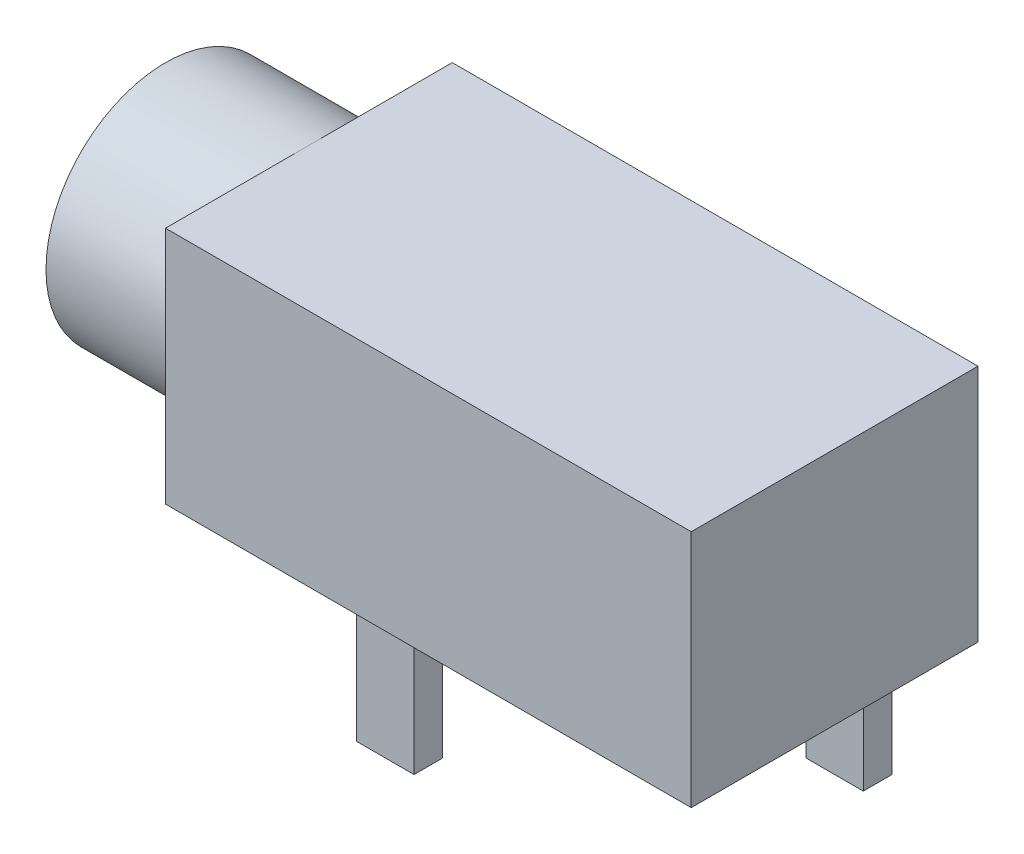
ISO-10303-21;
HEADER;
FILE_DESCRIPTION(('STEP AP214'),'2;1');
FILE_NAME('part.step','',(''),(''),'','','');
FILE_SCHEMA(('AUTOMOTIVE_DESIGN { 1 0 10303 214 1 1 1 1 }'));
ENDSEC;
DATA;
#1=APPLICATION_CONTEXT('core data for automotive mechanical design processes');
#2=APPLICATION_PROTOCOL_DEFINITION('international standard','automotive_design',2000,#1);
#3=PRODUCT_CONTEXT('',#1,'mechanical');
#4=PRODUCT('Part','Part','',(#3));
#5=PRODUCT_RELATED_PRODUCT_CATEGORY('part','',(#4));
#6=PRODUCT_DEFINITION_FORMATION('','',#4);
#7=PRODUCT_DEFINITION_CONTEXT('part definition',#1,'design');
#8=PRODUCT_DEFINITION('design','',#6,#7);
#9=PRODUCT_DEFINITION_SHAPE('','',#8);
#10=(LENGTH_UNIT() NAMED_UNIT(*) SI_UNIT(.MILLI.,.METRE.));
#11=(NAMED_UNIT(*) PLANE_ANGLE_UNIT() SI_UNIT($,.RADIAN.));
#12=(NAMED_UNIT(*) SI_UNIT($,.STERADIAN.) SOLID_ANGLE_UNIT());
#13=UNCERTAINTY_MEASURE_WITH_UNIT(LENGTH_MEASURE(1.E-05),#10,'distance_accuracy_value','');
#14=(GEOMETRIC_REPRESENTATION_CONTEXT(3) GLOBAL_UNCERTAINTY_ASSIGNED_CONTEXT((#13)) GLOBAL_UNIT_ASSIGNED_CONTEXT((#10,
#11,#12)) REPRESENTATION_CONTEXT('',''));
#15=CARTESIAN_POINT('',(0.,0.,0.));
#16=DIRECTION('',(0.,0.,1.));
#17=DIRECTION('',(1.,0.,0.));
#18=AXIS2_PLACEMENT_3D('',#15,#16,#17);
#19=CARTESIAN_POINT('',(0.,0.,0.));
#20=DIRECTION('',(0.,1.,0.));
#21=DIRECTION('',(0.,0.,1.));
#22=AXIS2_PLACEMENT_3D('',#19,#20,#21);
#23=PLANE('',#22);
#24=DIRECTION('',(0.,0.,-1.));
#25=VECTOR('',#24,1.);
#26=CARTESIAN_POINT('',(8.5,0.,1.1));
#27=LINE('',#26,#25);
#28=CARTESIAN_POINT('',(8.5,0.,1.1));
#29=VERTEX_POINT('',#28);
#30=CARTESIAN_POINT('',(8.5,0.,0.5));
#31=VERTEX_POINT('',#30);
#32=EDGE_CURVE('E175',#29,#31,#27,.T.);
#33=ORIENTED_EDGE('',*,*,#32,.F.);
#34=DIRECTION('',(-1.,0.,0.));
#35=VECTOR('',#34,1.);
#36=CARTESIAN_POINT('',(8.5,0.,1.1));
#37=LINE('',#36,#35);
#38=CARTESIAN_POINT('',(9.7,0.,1.1));
#39=VERTEX_POINT('',#38);
#40=EDGE_CURVE('E188',#39,#29,#37,.T.);
#41=ORIENTED_EDGE('',*,*,#40,.F.);
#42=DIRECTION('',(0.,0.,1.));
#43=VECTOR('',#42,1.);
#44=CARTESIAN_POINT('',(9.7,0.,1.1));
#45=LINE('',#44,#43);
#46=CARTESIAN_POINT('',(9.7,0.,0.5));
#47=VERTEX_POINT('',#46);
#48=EDGE_CURVE('E197',#47,#39,#45,.T.);
#49=ORIENTED_EDGE('',*,*,#48,.F.);
#50=DIRECTION('',(1.,0.,0.));
#51=VECTOR('',#50,1.);
#52=CARTESIAN_POINT('',(8.5,0.,0.5));
#53=LINE('',#52,#51);
#54=EDGE_CURVE('E178',#31,#47,#53,.T.);
#55=ORIENTED_EDGE('',*,*,#54,.F.);
#56=EDGE_LOOP('',(#33,#41,#49,#55));
#57=FACE_BOUND('',#56,.T.);
#58=DIRECTION('',(0.,0.,1.));
#59=VECTOR('',#58,1.);
#60=CARTESIAN_POINT('',(0.,0.,0.));
#61=LINE('',#60,#59);
#62=CARTESIAN_POINT('',(0.,0.,0.));
#63=VERTEX_POINT('',#62);
#64=CARTESIAN_POINT('',(0.,0.,3.));
#65=VERTEX_POINT('',#64);
#66=EDGE_CURVE('E261',#63,#65,#61,.T.);
#67=ORIENTED_EDGE('',*,*,#66,.F.);
#68=DIRECTION('',(-1.,0.,0.));
#69=VECTOR('',#68,1.);
#70=CARTESIAN_POINT('',(0.,0.,0.));
#71=LINE('',#70,#69);
#72=CARTESIAN_POINT('',(11.,0.,0.));
#73=VERTEX_POINT('',#72);
#74=EDGE_CURVE('E268',#73,#63,#71,.T.);
#75=ORIENTED_EDGE('',*,*,#74,.F.);
#76=DIRECTION('',(0.,0.,-1.));
#77=VECTOR('',#76,1.);
#78=CARTESIAN_POINT('',(11.,0.,0.));
#79=LINE('',#78,#77);
#80=CARTESIAN_POINT('',(11.,0.,6.));
#81=VERTEX_POINT('',#80);
#82=EDGE_CURVE('E266',#81,#73,#79,.T.);
#83=ORIENTED_EDGE('',*,*,#82,.F.);
#84=DIRECTION('',(1.,0.,0.));
#85=VECTOR('',#84,1.);
#86=CARTESIAN_POINT('',(0.,0.,6.));
#87=LINE('',#86,#85);
#88=CARTESIAN_POINT('',(0.,0.,6.));
#89=VERTEX_POINT('',#88);
#90=EDGE_CURVE('E264',#89,#81,#87,.T.);
#91=ORIENTED_EDGE('',*,*,#90,.F.);
#92=EDGE_CURVE('E248',#65,#89,#61,.T.);
#93=ORIENTED_EDGE('',*,*,#92,.F.);
#94=EDGE_LOOP('',(#67,#75,#83,#91,#93));
#95=FACE_BOUND('',#94,.T.);
#96=DIRECTION('',(0.,0.,-1.));
#97=VECTOR('',#96,1.);
#98=CARTESIAN_POINT('',(1.5,0.,1.1));
#99=LINE('',#98,#97);
#100=CARTESIAN_POINT('',(1.5,0.,1.1));
#101=VERTEX_POINT('',#100);
#102=CARTESIAN_POINT('',(1.5,0.,0.5));
#103=VERTEX_POINT('',#102);
#104=EDGE_CURVE('E213',#101,#103,#99,.T.);
#105=ORIENTED_EDGE('',*,*,#104,.F.);
#106=DIRECTION('',(-1.,0.,0.));
#107=VECTOR('',#106,1.);
#108=CARTESIAN_POINT('',(1.5,0.,1.1));
#109=LINE('',#108,#107);
#110=CARTESIAN_POINT('',(2.7,0.,1.1));
#111=VERTEX_POINT('',#110);
#112=EDGE_CURVE('E218',#111,#101,#109,.T.);
#113=ORIENTED_EDGE('',*,*,#112,.F.);
#114=DIRECTION('',(0.,0.,1.));
#115=VECTOR('',#114,1.);
#116=CARTESIAN_POINT('',(2.7,0.,1.1));
#117=LINE('',#116,#115);
#118=CARTESIAN_POINT('',(2.7,0.,0.5));
#119=VERTEX_POINT('',#118);
#120=EDGE_CURVE('E230',#119,#111,#117,.T.);
#121=ORIENTED_EDGE('',*,*,#120,.F.);
#122=DIRECTION('',(1.,0.,0.));
#123=VECTOR('',#122,1.);
#124=CARTESIAN_POINT('',(1.5,0.,0.5));
#125=LINE('',#124,#123);
#126=EDGE_CURVE('E227',#103,#119,#125,.T.);
#127=ORIENTED_EDGE('',*,*,#126,.F.);
#128=EDGE_LOOP('',(#105,#113,#121,#127));
#129=FACE_BOUND('',#128,.T.);
#130=DIRECTION('',(0.,0.,-1.));
#131=VECTOR('',#130,1.);
#132=CARTESIAN_POINT('',(3.5,0.,5.5));
#133=LINE('',#132,#131);
#134=CARTESIAN_POINT('',(3.5,0.,5.5));
#135=VERTEX_POINT('',#134);
#136=CARTESIAN_POINT('',(3.5,0.,4.9));
#137=VERTEX_POINT('',#136);
#138=EDGE_CURVE('E174',#135,#137,#133,.T.);
#139=ORIENTED_EDGE('',*,*,#138,.F.);
#140=DIRECTION('',(-1.,0.,0.));
#141=VECTOR('',#140,1.);
#142=CARTESIAN_POINT('',(3.5,0.,5.5));
#143=LINE('',#142,#141);
#144=CARTESIAN_POINT('',(4.7,0.,5.5));
#145=VERTEX_POINT('',#144);
#146=EDGE_CURVE('E171',#145,#135,#143,.T.);
#147=ORIENTED_EDGE('',*,*,#146,.F.);
#148=DIRECTION('',(0.,0.,1.));
#149=VECTOR('',#148,1.);
#150=CARTESIAN_POINT('',(4.7,0.,5.5));
#151=LINE('',#150,#149);
#152=CARTESIAN_POINT('',(4.7,0.,4.9));
#153=VERTEX_POINT('',#152);
#154=EDGE_CURVE('E55',#153,#145,#151,.T.);
#155=ORIENTED_EDGE('',*,*,#154,.F.);
#156=DIRECTION('',(1.,0.,0.));
#157=VECTOR('',#156,1.);
#158=CARTESIAN_POINT('',(3.5,0.,4.9));
#159=LINE('',#158,#157);
#160=EDGE_CURVE('E50',#137,#153,#159,.T.);
#161=ORIENTED_EDGE('',*,*,#160,.F.);
#162=EDGE_LOOP('',(#139,#147,#155,#161));
#163=FACE_BOUND('',#162,.T.);
#164=ADVANCED_FACE('F33',(#57,#95,#129,#163),#23,.F.);
#165=CARTESIAN_POINT('',(0.,5.,0.));
#166=DIRECTION('',(1.,0.,0.));
#167=DIRECTION('',(0.,0.,-1.));
#168=AXIS2_PLACEMENT_3D('',#165,#166,#167);
#169=PLANE('',#168);
#170=CARTESIAN_POINT('',(0.,2.5,3.));
#171=DIRECTION('',(-1.,0.,0.));
#172=DIRECTION('',(0.,0.,1.));
#173=AXIS2_PLACEMENT_3D('',#170,#171,#172);
#174=CIRCLE('',#173,2.5);
#175=CARTESIAN_POINT('',(0.,5.,3.));
#176=VERTEX_POINT('',#175);
#177=EDGE_CURVE('E43',#176,#65,#174,.T.);
#178=ORIENTED_EDGE('',*,*,#177,.F.);
#179=DIRECTION('',(0.,0.,1.));
#180=VECTOR('',#179,1.);
#181=CARTESIAN_POINT('',(0.,5.,0.));
#182=LINE('',#181,#180);
#183=CARTESIAN_POINT('',(0.,5.,0.));
#184=VERTEX_POINT('',#183);
#185=EDGE_CURVE('E251',#184,#176,#182,.T.);
#186=ORIENTED_EDGE('',*,*,#185,.F.);
#187=DIRECTION('',(0.,-1.,0.));
#188=VECTOR('',#187,1.);
#189=CARTESIAN_POINT('',(0.,5.,0.));
#190=LINE('',#189,#188);
#191=EDGE_CURVE('E260',#184,#63,#190,.T.);
#192=ORIENTED_EDGE('',*,*,#191,.T.);
#193=ORIENTED_EDGE('',*,*,#66,.T.);
#194=EDGE_LOOP('',(#178,#186,#192,#193));
#195=FACE_BOUND('',#194,.T.);
#196=ADVANCED_FACE('F304',(#195),#169,.F.);
#197=EDGE_CURVE('E11',#65,#176,#174,.T.);
#198=ORIENTED_EDGE('',*,*,#197,.F.);
#199=ORIENTED_EDGE('',*,*,#92,.T.);
#200=DIRECTION('',(0.,-1.,0.));
#201=VECTOR('',#200,1.);
#202=CARTESIAN_POINT('',(0.,5.,6.));
#203=LINE('',#202,#201);
#204=CARTESIAN_POINT('',(0.,5.,6.));
#205=VERTEX_POINT('',#204);
#206=EDGE_CURVE('E37',#205,#89,#203,.T.);
#207=ORIENTED_EDGE('',*,*,#206,.F.);
#208=EDGE_CURVE('E254',#176,#205,#182,.T.);
#209=ORIENTED_EDGE('',*,*,#208,.F.);
#210=EDGE_LOOP('',(#198,#199,#207,#209));
#211=FACE_BOUND('',#210,.T.);
#212=ADVANCED_FACE('F35',(#211),#169,.F.);
#213=CARTESIAN_POINT('',(0.,5.,6.));
#214=DIRECTION('',(0.,0.,-1.));
#215=DIRECTION('',(-1.,0.,0.));
#216=AXIS2_PLACEMENT_3D('',#213,#214,#215);
#217=PLANE('',#216);
#218=ORIENTED_EDGE('',*,*,#90,.T.);
#219=DIRECTION('',(0.,-1.,0.));
#220=VECTOR('',#219,1.);
#221=CARTESIAN_POINT('',(11.,5.,6.));
#222=LINE('',#221,#220);
#223=CARTESIAN_POINT('',(11.,5.,6.));
#224=VERTEX_POINT('',#223);
#225=EDGE_CURVE('E274',#224,#81,#222,.T.);
#226=ORIENTED_EDGE('',*,*,#225,.F.);
#227=DIRECTION('',(1.,0.,0.));
#228=VECTOR('',#227,1.);
#229=CARTESIAN_POINT('',(0.,5.,6.));
#230=LINE('',#229,#228);
#231=EDGE_CURVE('E253',#205,#224,#230,.T.);
#232=ORIENTED_EDGE('',*,*,#231,.F.);
#233=ORIENTED_EDGE('',*,*,#206,.T.);
#234=EDGE_LOOP('',(#218,#226,#232,#233));
#235=FACE_BOUND('',#234,.T.);
#236=ADVANCED_FACE('F284',(#235),#217,.F.);
#237=CARTESIAN_POINT('',(11.,5.,0.));
#238=DIRECTION('',(-1.,0.,0.));
#239=DIRECTION('',(0.,0.,1.));
#240=AXIS2_PLACEMENT_3D('',#237,#238,#239);
#241=PLANE('',#240);
#242=ORIENTED_EDGE('',*,*,#82,.T.);
#243=DIRECTION('',(0.,-1.,0.));
#244=VECTOR('',#243,1.);
#245=CARTESIAN_POINT('',(11.,5.,0.));
#246=LINE('',#245,#244);
#247=CARTESIAN_POINT('',(11.,5.,0.));
#248=VERTEX_POINT('',#247);
#249=EDGE_CURVE('E272',#248,#73,#246,.T.);
#250=ORIENTED_EDGE('',*,*,#249,.F.);
#251=DIRECTION('',(0.,0.,-1.));
#252=VECTOR('',#251,1.);
#253=CARTESIAN_POINT('',(11.,5.,0.));
#254=LINE('',#253,#252);
#255=EDGE_CURVE('E256',#224,#248,#254,.T.);
#256=ORIENTED_EDGE('',*,*,#255,.F.);
#257=ORIENTED_EDGE('',*,*,#225,.T.);
#258=EDGE_LOOP('',(#242,#250,#256,#257));
#259=FACE_BOUND('',#258,.T.);
#260=ADVANCED_FACE('F295',(#259),#241,.F.);
#261=CARTESIAN_POINT('',(0.,5.,0.));
#262=DIRECTION('',(0.,0.,1.));
#263=DIRECTION('',(1.,0.,0.));
#264=AXIS2_PLACEMENT_3D('',#261,#262,#263);
#265=PLANE('',#264);
#266=ORIENTED_EDGE('',*,*,#74,.T.);
#267=ORIENTED_EDGE('',*,*,#191,.F.);
#268=DIRECTION('',(-1.,0.,0.));
#269=VECTOR('',#268,1.);
#270=CARTESIAN_POINT('',(0.,5.,0.));
#271=LINE('',#270,#269);
#272=EDGE_CURVE('E258',#248,#184,#271,.T.);
#273=ORIENTED_EDGE('',*,*,#272,.F.);
#274=ORIENTED_EDGE('',*,*,#249,.T.);
#275=EDGE_LOOP('',(#266,#267,#273,#274));
#276=FACE_BOUND('',#275,.T.);
#277=ADVANCED_FACE('F298',(#276),#265,.F.);
#278=CARTESIAN_POINT('',(0.,5.,0.));
#279=DIRECTION('',(0.,1.,0.));
#280=DIRECTION('',(0.,0.,1.));
#281=AXIS2_PLACEMENT_3D('',#278,#279,#280);
#282=PLANE('',#281);
#283=ORIENTED_EDGE('',*,*,#185,.T.);
#284=ORIENTED_EDGE('',*,*,#208,.T.);
#285=ORIENTED_EDGE('',*,*,#231,.T.);
#286=ORIENTED_EDGE('',*,*,#255,.T.);
#287=ORIENTED_EDGE('',*,*,#272,.T.);
#288=EDGE_LOOP('',(#283,#284,#285,#286,#287));
#289=FACE_BOUND('',#288,.T.);
#290=ADVANCED_FACE('F302',(#289),#282,.T.);
#291=CARTESIAN_POINT('',(-3.,2.5,3.));
#292=DIRECTION('',(1.,0.,0.));
#293=DIRECTION('',(0.,0.,-1.));
#294=AXIS2_PLACEMENT_3D('',#291,#292,#293);
#295=CYLINDRICAL_SURFACE('',#294,2.5);
#296=CARTESIAN_POINT('',(-3.,2.5,3.));
#297=DIRECTION('',(-1.,0.,0.));
#298=DIRECTION('',(0.,0.,1.));
#299=AXIS2_PLACEMENT_3D('',#296,#297,#298);
#300=CIRCLE('',#299,2.5);
#301=CARTESIAN_POINT('',(-3.,2.5,5.5));
#302=VERTEX_POINT('',#301);
#303=EDGE_CURVE('E246',#302,#302,#300,.T.);
#304=ORIENTED_EDGE('',*,*,#303,.F.);
#305=EDGE_LOOP('',(#304));
#306=FACE_BOUND('',#305,.T.);
#307=ORIENTED_EDGE('',*,*,#177,.T.);
#308=ORIENTED_EDGE('',*,*,#197,.T.);
#309=EDGE_LOOP('',(#307,#308));
#310=FACE_BOUND('',#309,.T.);
#311=ADVANCED_FACE('F306',(#306,#310),#295,.T.);
#312=CARTESIAN_POINT('',(-3.,2.5,3.));
#313=DIRECTION('',(-1.,0.,0.));
#314=DIRECTION('',(0.,0.,1.));
#315=AXIS2_PLACEMENT_3D('',#312,#313,#314);
#316=PLANE('',#315);
#317=ORIENTED_EDGE('',*,*,#303,.T.);
#318=EDGE_LOOP('',(#317));
#319=FACE_BOUND('',#318,.T.);
#320=ADVANCED_FACE('F308',(#319),#316,.T.);
#321=CARTESIAN_POINT('',(1.5,-2.8,1.1));
#322=DIRECTION('',(1.,0.,0.));
#323=DIRECTION('',(0.,0.,-1.));
#324=AXIS2_PLACEMENT_3D('',#321,#322,#323);
#325=PLANE('',#324);
#326=ORIENTED_EDGE('',*,*,#104,.T.);
#327=DIRECTION('',(0.,1.,0.));
#328=VECTOR('',#327,1.);
#329=CARTESIAN_POINT('',(1.5,-2.8,0.5));
#330=LINE('',#329,#328);
#331=CARTESIAN_POINT('',(1.5,-2.8,0.5));
#332=VERTEX_POINT('',#331);
#333=EDGE_CURVE('E243',#332,#103,#330,.T.);
#334=ORIENTED_EDGE('',*,*,#333,.F.);
#335=DIRECTION('',(0.,0.,-1.));
#336=VECTOR('',#335,1.);
#337=CARTESIAN_POINT('',(1.5,-2.8,1.1));
#338=LINE('',#337,#336);
#339=CARTESIAN_POINT('',(1.5,-2.8,1.1));
#340=VERTEX_POINT('',#339);
#341=EDGE_CURVE('E214',#340,#332,#338,.T.);
#342=ORIENTED_EDGE('',*,*,#341,.F.);
#343=DIRECTION('',(0.,1.,0.));
#344=VECTOR('',#343,1.);
#345=CARTESIAN_POINT('',(1.5,-2.8,1.1));
#346=LINE('',#345,#344);
#347=EDGE_CURVE('E224',#340,#101,#346,.T.);
#348=ORIENTED_EDGE('',*,*,#347,.T.);
#349=EDGE_LOOP('',(#326,#334,#342,#348));
#350=FACE_BOUND('',#349,.T.);
#351=ADVANCED_FACE('F315',(#350),#325,.F.);
#352=CARTESIAN_POINT('',(1.5,-2.8,0.5));
#353=DIRECTION('',(0.,0.,1.));
#354=DIRECTION('',(1.,0.,0.));
#355=AXIS2_PLACEMENT_3D('',#352,#353,#354);
#356=PLANE('',#355);
#357=ORIENTED_EDGE('',*,*,#126,.T.);
#358=DIRECTION('',(0.,1.,0.));
#359=VECTOR('',#358,1.);
#360=CARTESIAN_POINT('',(2.7,-2.8,0.5));
#361=LINE('',#360,#359);
#362=CARTESIAN_POINT('',(2.7,-2.8,0.5));
#363=VERTEX_POINT('',#362);
#364=EDGE_CURVE('E240',#363,#119,#361,.T.);
#365=ORIENTED_EDGE('',*,*,#364,.F.);
#366=DIRECTION('',(1.,0.,0.));
#367=VECTOR('',#366,1.);
#368=CARTESIAN_POINT('',(1.5,-2.8,0.5));
#369=LINE('',#368,#367);
#370=EDGE_CURVE('E217',#332,#363,#369,.T.);
#371=ORIENTED_EDGE('',*,*,#370,.F.);
#372=ORIENTED_EDGE('',*,*,#333,.T.);
#373=EDGE_LOOP('',(#357,#365,#371,#372));
#374=FACE_BOUND('',#373,.T.);
#375=ADVANCED_FACE('F387',(#374),#356,.F.);
#376=CARTESIAN_POINT('',(2.7,-2.8,1.1));
#377=DIRECTION('',(-1.,0.,0.));
#378=DIRECTION('',(0.,0.,1.));
#379=AXIS2_PLACEMENT_3D('',#376,#377,#378);
#380=PLANE('',#379);
#381=ORIENTED_EDGE('',*,*,#120,.T.);
#382=DIRECTION('',(0.,1.,0.));
#383=VECTOR('',#382,1.);
#384=CARTESIAN_POINT('',(2.7,-2.8,1.1));
#385=LINE('',#384,#383);
#386=CARTESIAN_POINT('',(2.7,-2.8,1.1));
#387=VERTEX_POINT('',#386);
#388=EDGE_CURVE('E237',#387,#111,#385,.T.);
#389=ORIENTED_EDGE('',*,*,#388,.F.);
#390=DIRECTION('',(0.,0.,1.));
#391=VECTOR('',#390,1.);
#392=CARTESIAN_POINT('',(2.7,-2.8,1.1));
#393=LINE('',#392,#391);
#394=EDGE_CURVE('E220',#363,#387,#393,.T.);
#395=ORIENTED_EDGE('',*,*,#394,.F.);
#396=ORIENTED_EDGE('',*,*,#364,.T.);
#397=EDGE_LOOP('',(#381,#389,#395,#396));
#398=FACE_BOUND('',#397,.T.);
#399=ADVANCED_FACE('F397',(#398),#380,.F.);
#400=CARTESIAN_POINT('',(1.5,-2.8,1.1));
#401=DIRECTION('',(0.,0.,-1.));
#402=DIRECTION('',(-1.,0.,0.));
#403=AXIS2_PLACEMENT_3D('',#400,#401,#402);
#404=PLANE('',#403);
#405=ORIENTED_EDGE('',*,*,#112,.T.);
#406=ORIENTED_EDGE('',*,*,#347,.F.);
#407=DIRECTION('',(-1.,0.,0.));
#408=VECTOR('',#407,1.);
#409=CARTESIAN_POINT('',(1.5,-2.8,1.1));
#410=LINE('',#409,#408);
#411=EDGE_CURVE('E222',#387,#340,#410,.T.);
#412=ORIENTED_EDGE('',*,*,#411,.F.);
#413=ORIENTED_EDGE('',*,*,#388,.T.);
#414=EDGE_LOOP('',(#405,#406,#412,#413));
#415=FACE_BOUND('',#414,.T.);
#416=ADVANCED_FACE('F407',(#415),#404,.F.);
#417=CARTESIAN_POINT('',(0.,-2.8,0.));
#418=DIRECTION('',(0.,-1.,0.));
#419=DIRECTION('',(0.,0.,-1.));
#420=AXIS2_PLACEMENT_3D('',#417,#418,#419);
#421=PLANE('',#420);
#422=ORIENTED_EDGE('',*,*,#341,.T.);
#423=ORIENTED_EDGE('',*,*,#370,.T.);
#424=ORIENTED_EDGE('',*,*,#394,.T.);
#425=ORIENTED_EDGE('',*,*,#411,.T.);
#426=EDGE_LOOP('',(#422,#423,#424,#425));
#427=FACE_BOUND('',#426,.T.);
#428=ADVANCED_FACE('F417',(#427),#421,.T.);
#429=CARTESIAN_POINT('',(8.5,-2.8,1.1));
#430=DIRECTION('',(1.,0.,0.));
#431=DIRECTION('',(0.,0.,-1.));
#432=AXIS2_PLACEMENT_3D('',#429,#430,#431);
#433=PLANE('',#432);
#434=ORIENTED_EDGE('',*,*,#32,.T.);
#435=DIRECTION('',(0.,1.,0.));
#436=VECTOR('',#435,1.);
#437=CARTESIAN_POINT('',(8.5,-2.8,0.5));
#438=LINE('',#437,#436);
#439=CARTESIAN_POINT('',(8.5,-2.8,0.5));
#440=VERTEX_POINT('',#439);
#441=EDGE_CURVE('E210',#440,#31,#438,.T.);
#442=ORIENTED_EDGE('',*,*,#441,.F.);
#443=DIRECTION('',(0.,0.,-1.));
#444=VECTOR('',#443,1.);
#445=CARTESIAN_POINT('',(8.5,-2.8,1.1));
#446=LINE('',#445,#444);
#447=CARTESIAN_POINT('',(8.5,-2.8,1.1));
#448=VERTEX_POINT('',#447);
#449=EDGE_CURVE('E184',#448,#440,#446,.T.);
#450=ORIENTED_EDGE('',*,*,#449,.F.);
#451=DIRECTION('',(0.,1.,0.));
#452=VECTOR('',#451,1.);
#453=CARTESIAN_POINT('',(8.5,-2.8,1.1));
#454=LINE('',#453,#452);
#455=EDGE_CURVE('E193',#448,#29,#454,.T.);
#456=ORIENTED_EDGE('',*,*,#455,.T.);
#457=EDGE_LOOP('',(#434,#442,#450,#456));
#458=FACE_BOUND('',#457,.T.);
#459=ADVANCED_FACE('F427',(#458),#433,.F.);
#460=CARTESIAN_POINT('',(8.5,-2.8,0.5));
#461=DIRECTION('',(0.,0.,1.));
#462=DIRECTION('',(1.,0.,0.));
#463=AXIS2_PLACEMENT_3D('',#460,#461,#462);
#464=PLANE('',#463);
#465=ORIENTED_EDGE('',*,*,#54,.T.);
#466=DIRECTION('',(0.,1.,0.));
#467=VECTOR('',#466,1.);
#468=CARTESIAN_POINT('',(9.7,-2.8,0.5));
#469=LINE('',#468,#467);
#470=CARTESIAN_POINT('',(9.7,-2.8,0.5));
#471=VERTEX_POINT('',#470);
#472=EDGE_CURVE('E207',#471,#47,#469,.T.);
#473=ORIENTED_EDGE('',*,*,#472,.F.);
#474=DIRECTION('',(1.,0.,0.));
#475=VECTOR('',#474,1.);
#476=CARTESIAN_POINT('',(8.5,-2.8,0.5));
#477=LINE('',#476,#475);
#478=EDGE_CURVE('E187',#440,#471,#477,.T.);
#479=ORIENTED_EDGE('',*,*,#478,.F.);
#480=ORIENTED_EDGE('',*,*,#441,.T.);
#481=EDGE_LOOP('',(#465,#473,#479,#480));
#482=FACE_BOUND('',#481,.T.);
#483=ADVANCED_FACE('F437',(#482),#464,.F.);
#484=CARTESIAN_POINT('',(9.7,-2.8,1.1));
#485=DIRECTION('',(-1.,0.,0.));
#486=DIRECTION('',(0.,0.,1.));
#487=AXIS2_PLACEMENT_3D('',#484,#485,#486);
#488=PLANE('',#487);
#489=ORIENTED_EDGE('',*,*,#48,.T.);
#490=DIRECTION('',(0.,1.,0.));
#491=VECTOR('',#490,1.);
#492=CARTESIAN_POINT('',(9.7,-2.8,1.1));
#493=LINE('',#492,#491);
#494=CARTESIAN_POINT('',(9.7,-2.8,1.1));
#495=VERTEX_POINT('',#494);
#496=EDGE_CURVE('E204',#495,#39,#493,.T.);
#497=ORIENTED_EDGE('',*,*,#496,.F.);
#498=DIRECTION('',(0.,0.,1.));
#499=VECTOR('',#498,1.);
#500=CARTESIAN_POINT('',(9.7,-2.8,1.1));
#501=LINE('',#500,#499);
#502=EDGE_CURVE('E190',#471,#495,#501,.T.);
#503=ORIENTED_EDGE('',*,*,#502,.F.);
#504=ORIENTED_EDGE('',*,*,#472,.T.);
#505=EDGE_LOOP('',(#489,#497,#503,#504));
#506=FACE_BOUND('',#505,.T.);
#507=ADVANCED_FACE('F447',(#506),#488,.F.);
#508=CARTESIAN_POINT('',(8.5,-2.8,1.1));
#509=DIRECTION('',(0.,0.,-1.));
#510=DIRECTION('',(-1.,0.,0.));
#511=AXIS2_PLACEMENT_3D('',#508,#509,#510);
#512=PLANE('',#511);
#513=ORIENTED_EDGE('',*,*,#40,.T.);
#514=ORIENTED_EDGE('',*,*,#455,.F.);
#515=DIRECTION('',(-1.,0.,0.));
#516=VECTOR('',#515,1.);
#517=CARTESIAN_POINT('',(8.5,-2.8,1.1));
#518=LINE('',#517,#516);
#519=EDGE_CURVE('E192',#495,#448,#518,.T.);
#520=ORIENTED_EDGE('',*,*,#519,.F.);
#521=ORIENTED_EDGE('',*,*,#496,.T.);
#522=EDGE_LOOP('',(#513,#514,#520,#521));
#523=FACE_BOUND('',#522,.T.);
#524=ADVANCED_FACE('F457',(#523),#512,.F.);
#525=CARTESIAN_POINT('',(0.,-2.8,0.));
#526=DIRECTION('',(0.,-1.,0.));
#527=DIRECTION('',(0.,0.,-1.));
#528=AXIS2_PLACEMENT_3D('',#525,#526,#527);
#529=PLANE('',#528);
#530=ORIENTED_EDGE('',*,*,#449,.T.);
#531=ORIENTED_EDGE('',*,*,#478,.T.);
#532=ORIENTED_EDGE('',*,*,#502,.T.);
#533=ORIENTED_EDGE('',*,*,#519,.T.);
#534=EDGE_LOOP('',(#530,#531,#532,#533));
#535=FACE_BOUND('',#534,.T.);
#536=ADVANCED_FACE('F467',(#535),#529,.T.);
#537=CARTESIAN_POINT('',(3.5,-2.8,5.5));
#538=DIRECTION('',(1.,0.,0.));
#539=DIRECTION('',(0.,0.,-1.));
#540=AXIS2_PLACEMENT_3D('',#537,#538,#539);
#541=PLANE('',#540);
#542=ORIENTED_EDGE('',*,*,#138,.T.);
#543=DIRECTION('',(0.,1.,0.));
#544=VECTOR('',#543,1.);
#545=CARTESIAN_POINT('',(3.5,-2.8,4.9));
#546=LINE('',#545,#544);
#547=CARTESIAN_POINT('',(3.5,-2.8,4.9));
#548=VERTEX_POINT('',#547);
#549=EDGE_CURVE('E155',#548,#137,#546,.T.);
#550=ORIENTED_EDGE('',*,*,#549,.F.);
#551=DIRECTION('',(0.,0.,-1.));
#552=VECTOR('',#551,1.);
#553=CARTESIAN_POINT('',(3.5,-2.8,5.5));
#554=LINE('',#553,#552);
#555=CARTESIAN_POINT('',(3.5,-2.8,5.5));
#556=VERTEX_POINT('',#555);
#557=EDGE_CURVE('E162',#556,#548,#554,.T.);
#558=ORIENTED_EDGE('',*,*,#557,.F.);
#559=DIRECTION('',(0.,1.,0.));
#560=VECTOR('',#559,1.);
#561=CARTESIAN_POINT('',(3.5,-2.8,5.5));
#562=LINE('',#561,#560);
#563=EDGE_CURVE('E527',#556,#135,#562,.T.);
#564=ORIENTED_EDGE('',*,*,#563,.T.);
#565=EDGE_LOOP('',(#542,#550,#558,#564));
#566=FACE_BOUND('',#565,.T.);
#567=ADVANCED_FACE('F173',(#566),#541,.F.);
#568=CARTESIAN_POINT('',(3.5,-2.8,4.9));
#569=DIRECTION('',(0.,0.,1.));
#570=DIRECTION('',(1.,0.,0.));
#571=AXIS2_PLACEMENT_3D('',#568,#569,#570);
#572=PLANE('',#571);
#573=ORIENTED_EDGE('',*,*,#160,.T.);
#574=DIRECTION('',(0.,1.,0.));
#575=VECTOR('',#574,1.);
#576=CARTESIAN_POINT('',(4.7,-2.8,4.9));
#577=LINE('',#576,#575);
#578=CARTESIAN_POINT('',(4.7,-2.8,4.9));
#579=VERTEX_POINT('',#578);
#580=EDGE_CURVE('E158',#579,#153,#577,.T.);
#581=ORIENTED_EDGE('',*,*,#580,.F.);
#582=DIRECTION('',(1.,0.,0.));
#583=VECTOR('',#582,1.);
#584=CARTESIAN_POINT('',(3.5,-2.8,4.9));
#585=LINE('',#584,#583);
#586=EDGE_CURVE('E151',#548,#579,#585,.T.);
#587=ORIENTED_EDGE('',*,*,#586,.F.);
#588=ORIENTED_EDGE('',*,*,#549,.T.);
#589=EDGE_LOOP('',(#573,#581,#587,#588));
#590=FACE_BOUND('',#589,.T.);
#591=ADVANCED_FACE('F153',(#590),#572,.F.);
#592=CARTESIAN_POINT('',(4.7,-2.8,5.5));
#593=DIRECTION('',(-1.,0.,0.));
#594=DIRECTION('',(0.,0.,1.));
#595=AXIS2_PLACEMENT_3D('',#592,#593,#594);
#596=PLANE('',#595);
#597=ORIENTED_EDGE('',*,*,#154,.T.);
#598=DIRECTION('',(0.,1.,0.));
#599=VECTOR('',#598,1.);
#600=CARTESIAN_POINT('',(4.7,-2.8,5.5));
#601=LINE('',#600,#599);
#602=CARTESIAN_POINT('',(4.7,-2.8,5.5));
#603=VERTEX_POINT('',#602);
#604=EDGE_CURVE('E180',#603,#145,#601,.T.);
#605=ORIENTED_EDGE('',*,*,#604,.F.);
#606=DIRECTION('',(0.,0.,1.));
#607=VECTOR('',#606,1.);
#608=CARTESIAN_POINT('',(4.7,-2.8,5.5));
#609=LINE('',#608,#607);
#610=EDGE_CURVE('E161',#579,#603,#609,.T.);
#611=ORIENTED_EDGE('',*,*,#610,.F.);
#612=ORIENTED_EDGE('',*,*,#580,.T.);
#613=EDGE_LOOP('',(#597,#605,#611,#612));
#614=FACE_BOUND('',#613,.T.);
#615=ADVANCED_FACE('F494',(#614),#596,.F.);
#616=CARTESIAN_POINT('',(3.5,-2.8,5.5));
#617=DIRECTION('',(0.,0.,-1.));
#618=DIRECTION('',(-1.,0.,0.));
#619=AXIS2_PLACEMENT_3D('',#616,#617,#618);
#620=PLANE('',#619);
#621=ORIENTED_EDGE('',*,*,#146,.T.);
#622=ORIENTED_EDGE('',*,*,#563,.F.);
#623=DIRECTION('',(-1.,0.,0.));
#624=VECTOR('',#623,1.);
#625=CARTESIAN_POINT('',(3.5,-2.8,5.5));
#626=LINE('',#625,#624);
#627=EDGE_CURVE('E167',#603,#556,#626,.T.);
#628=ORIENTED_EDGE('',*,*,#627,.F.);
#629=ORIENTED_EDGE('',*,*,#604,.T.);
#630=EDGE_LOOP('',(#621,#622,#628,#629));
#631=FACE_BOUND('',#630,.T.);
#632=ADVANCED_FACE('F503',(#631),#620,.F.);
#633=CARTESIAN_POINT('',(0.,-2.8,0.));
#634=DIRECTION('',(0.,-1.,0.));
#635=DIRECTION('',(0.,0.,-1.));
#636=AXIS2_PLACEMENT_3D('',#633,#634,#635);
#637=PLANE('',#636);
#638=ORIENTED_EDGE('',*,*,#557,.T.);
#639=ORIENTED_EDGE('',*,*,#586,.T.);
#640=ORIENTED_EDGE('',*,*,#610,.T.);
#641=ORIENTED_EDGE('',*,*,#627,.T.);
#642=EDGE_LOOP('',(#638,#639,#640,#641));
#643=FACE_BOUND('',#642,.T.);
#644=ADVANCED_FACE('F165',(#643),#637,.T.);
#645=CLOSED_SHELL('',(#164,#196,#212,#236,#260,#277,#290,#311,#320,#351,#375,#399,#416,#428,
#459,#483,#507,#524,#536,#567,#591,#615,#632,#644));
#646=MANIFOLD_SOLID_BREP('B2',#645);
#647=ADVANCED_BREP_SHAPE_REPRESENTATION('',(#18,#646),#14);
#648=SHAPE_DEFINITION_REPRESENTATION(#9,#647);
ENDSEC;
END-ISO-10303-21;
